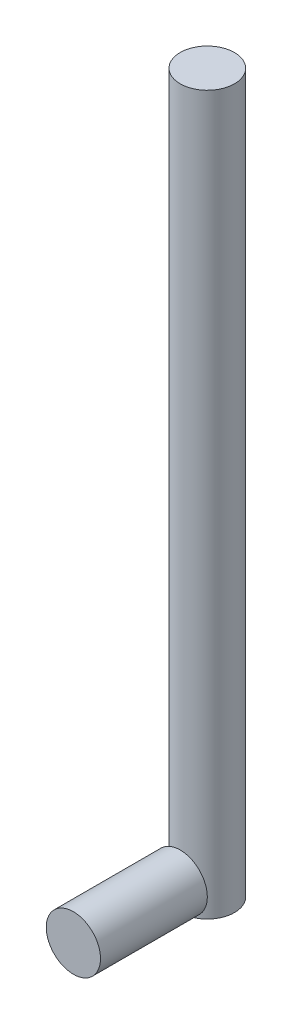
ISO-10303-21;
HEADER;
FILE_DESCRIPTION(('STEP AP214'),'2;1');
FILE_NAME('part.step','',(''),(''),'','','');
FILE_SCHEMA(('AUTOMOTIVE_DESIGN { 1 0 10303 214 1 1 1 1 }'));
ENDSEC;
DATA;
#1=APPLICATION_CONTEXT('core data for automotive mechanical design processes');
#2=APPLICATION_PROTOCOL_DEFINITION('international standard','automotive_design',2000,#1);
#3=PRODUCT_CONTEXT('',#1,'mechanical');
#4=PRODUCT('Part','Part','',(#3));
#5=PRODUCT_RELATED_PRODUCT_CATEGORY('part','',(#4));
#6=PRODUCT_DEFINITION_FORMATION('','',#4);
#7=PRODUCT_DEFINITION_CONTEXT('part definition',#1,'design');
#8=PRODUCT_DEFINITION('design','',#6,#7);
#9=PRODUCT_DEFINITION_SHAPE('','',#8);
#10=(LENGTH_UNIT() NAMED_UNIT(*) SI_UNIT(.MILLI.,.METRE.));
#11=(NAMED_UNIT(*) PLANE_ANGLE_UNIT() SI_UNIT($,.RADIAN.));
#12=(NAMED_UNIT(*) SI_UNIT($,.STERADIAN.) SOLID_ANGLE_UNIT());
#13=UNCERTAINTY_MEASURE_WITH_UNIT(LENGTH_MEASURE(1.E-05),#10,'distance_accuracy_value','');
#14=(GEOMETRIC_REPRESENTATION_CONTEXT(3) GLOBAL_UNCERTAINTY_ASSIGNED_CONTEXT((#13)) GLOBAL_UNIT_ASSIGNED_CONTEXT((#10,
#11,#12)) REPRESENTATION_CONTEXT('',''));
#15=CARTESIAN_POINT('',(0.,0.,0.));
#16=DIRECTION('',(0.,0.,1.));
#17=DIRECTION('',(1.,0.,0.));
#18=AXIS2_PLACEMENT_3D('',#15,#16,#17);
#19=CARTESIAN_POINT('',(0.,6.5,32.1));
#20=DIRECTION('',(0.,0.,-1.));
#21=DIRECTION('',(-1.,0.,0.));
#22=AXIS2_PLACEMENT_3D('',#19,#20,#21);
#23=CYLINDRICAL_SURFACE('',#22,6.5);
#24=CARTESIAN_POINT('',(0.,6.5,32.1));
#25=DIRECTION('',(0.,0.,1.));
#26=DIRECTION('',(1.,0.,0.));
#27=AXIS2_PLACEMENT_3D('',#24,#25,#26);
#28=CIRCLE('',#27,6.5);
#29=CARTESIAN_POINT('',(6.5,6.5,32.1));
#30=VERTEX_POINT('',#29);
#31=EDGE_CURVE('E11',#30,#30,#28,.T.);
#32=ORIENTED_EDGE('',*,*,#31,.F.);
#33=EDGE_LOOP('',(#32));
#34=FACE_BOUND('',#33,.T.);
#35=CARTESIAN_POINT('',(0.,6.5,6.5));
#36=DIRECTION('',(0.,0.,1.));
#37=DIRECTION('',(1.,0.,0.));
#38=AXIS2_PLACEMENT_3D('',#35,#36,#37);
#39=CIRCLE('',#38,6.5);
#40=CARTESIAN_POINT('',(6.5,6.5,6.5));
#41=VERTEX_POINT('',#40);
#42=EDGE_CURVE('E45',#41,#41,#39,.T.);
#43=ORIENTED_EDGE('',*,*,#42,.T.);
#44=EDGE_LOOP('',(#43));
#45=FACE_BOUND('',#44,.T.);
#46=ADVANCED_FACE('F42',(#34,#45),#23,.T.);
#47=CARTESIAN_POINT('',(0.,6.5,32.1));
#48=DIRECTION('',(0.,0.,1.));
#49=DIRECTION('',(1.,0.,0.));
#50=AXIS2_PLACEMENT_3D('',#47,#48,#49);
#51=PLANE('',#50);
#52=ORIENTED_EDGE('',*,*,#31,.T.);
#53=EDGE_LOOP('',(#52));
#54=FACE_BOUND('',#53,.T.);
#55=ADVANCED_FACE('F57',(#54),#51,.T.);
#56=CARTESIAN_POINT('',(0.,6.5,6.5));
#57=DIRECTION('',(0.,0.,1.));
#58=DIRECTION('',(1.,0.,0.));
#59=AXIS2_PLACEMENT_3D('',#56,#57,#58);
#60=PLANE('',#59);
#61=ORIENTED_EDGE('',*,*,#42,.F.);
#62=EDGE_LOOP('',(#61));
#63=FACE_BOUND('',#62,.T.);
#64=ADVANCED_FACE('F55',(#63),#60,.F.);
#65=CLOSED_SHELL('',(#46,#55,#64));
#66=MANIFOLD_SOLID_BREP('B2',#65);
#67=CARTESIAN_POINT('',(0.,172.,0.));
#68=DIRECTION('',(0.,-1.,0.));
#69=DIRECTION('',(0.,0.,-1.));
#70=AXIS2_PLACEMENT_3D('',#67,#68,#69);
#71=CYLINDRICAL_SURFACE('',#70,6.5);
#72=CARTESIAN_POINT('',(0.,0.,0.));
#73=DIRECTION('',(0.,1.,0.));
#74=DIRECTION('',(0.,0.,1.));
#75=AXIS2_PLACEMENT_3D('',#72,#73,#74);
#76=CIRCLE('',#75,6.5);
#77=CARTESIAN_POINT('',(0.,0.,6.5));
#78=VERTEX_POINT('',#77);
#79=EDGE_CURVE('E85',#78,#78,#76,.T.);
#80=ORIENTED_EDGE('',*,*,#79,.T.);
#81=EDGE_LOOP('',(#80));
#82=FACE_BOUND('',#81,.T.);
#83=CARTESIAN_POINT('',(0.,172.,0.));
#84=DIRECTION('',(0.,1.,0.));
#85=DIRECTION('',(0.,0.,1.));
#86=AXIS2_PLACEMENT_3D('',#83,#84,#85);
#87=CIRCLE('',#86,6.5);
#88=CARTESIAN_POINT('',(0.,172.,6.5));
#89=VERTEX_POINT('',#88);
#90=EDGE_CURVE('E41',#89,#89,#87,.T.);
#91=ORIENTED_EDGE('',*,*,#90,.F.);
#92=EDGE_LOOP('',(#91));
#93=FACE_BOUND('',#92,.T.);
#94=ADVANCED_FACE('F82',(#82,#93),#71,.T.);
#95=CARTESIAN_POINT('',(0.,172.,0.));
#96=DIRECTION('',(0.,1.,0.));
#97=DIRECTION('',(0.,0.,1.));
#98=AXIS2_PLACEMENT_3D('',#95,#96,#97);
#99=PLANE('',#98);
#100=ORIENTED_EDGE('',*,*,#90,.T.);
#101=EDGE_LOOP('',(#100));
#102=FACE_BOUND('',#101,.T.);
#103=ADVANCED_FACE('F98',(#102),#99,.T.);
#104=CARTESIAN_POINT('',(0.,0.,0.));
#105=DIRECTION('',(0.,1.,0.));
#106=DIRECTION('',(0.,0.,1.));
#107=AXIS2_PLACEMENT_3D('',#104,#105,#106);
#108=PLANE('',#107);
#109=ORIENTED_EDGE('',*,*,#79,.F.);
#110=EDGE_LOOP('',(#109));
#111=FACE_BOUND('',#110,.T.);
#112=ADVANCED_FACE('F96',(#111),#108,.F.);
#113=CLOSED_SHELL('',(#94,#103,#112));
#114=MANIFOLD_SOLID_BREP('B6',#113);
#115=ADVANCED_BREP_SHAPE_REPRESENTATION('',(#18,#66,#114),#14);
#116=SHAPE_DEFINITION_REPRESENTATION(#9,#115);
ENDSEC;
END-ISO-10303-21;
